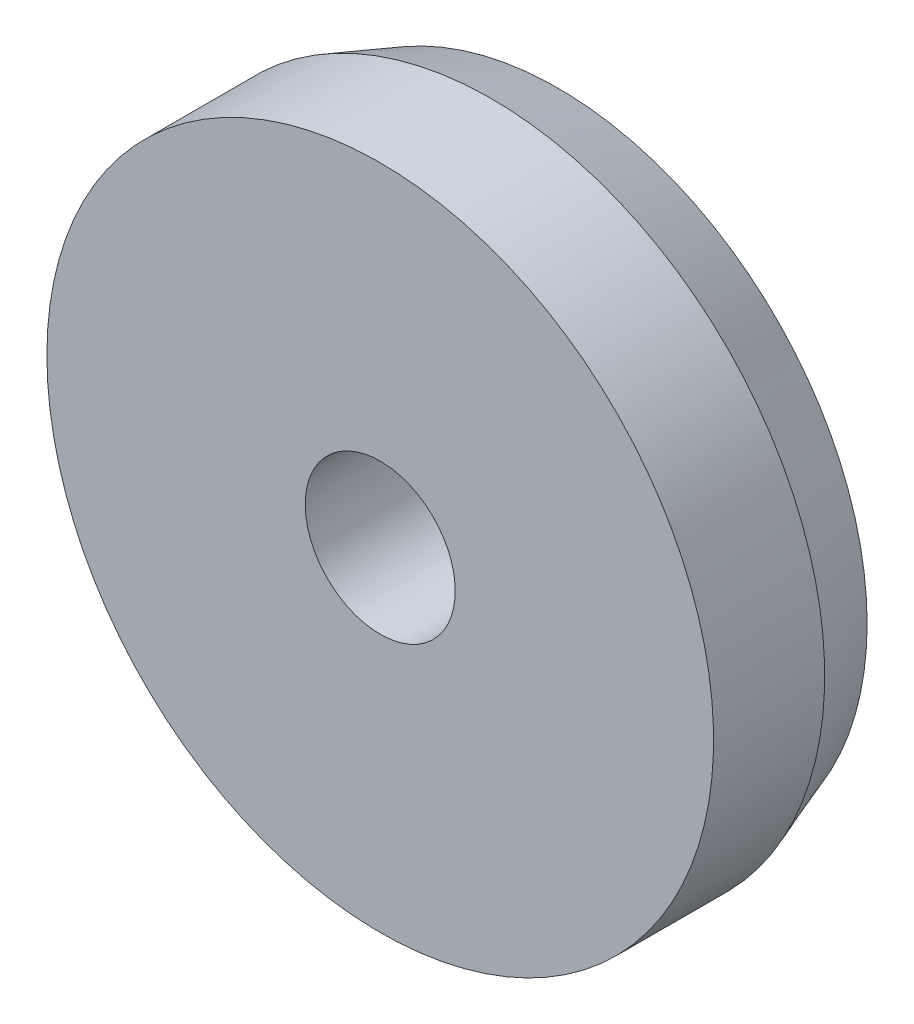
ISO-10303-21;
HEADER;
FILE_DESCRIPTION(('STEP AP214'),'2;1');
FILE_NAME('part.step','',(''),(''),'','','');
FILE_SCHEMA(('AUTOMOTIVE_DESIGN { 1 0 10303 214 1 1 1 1 }'));
ENDSEC;
DATA;
#1=APPLICATION_CONTEXT('core data for automotive mechanical design processes');
#2=APPLICATION_PROTOCOL_DEFINITION('international standard','automotive_design',2000,#1);
#3=PRODUCT_CONTEXT('',#1,'mechanical');
#4=PRODUCT('Part','Part','',(#3));
#5=PRODUCT_RELATED_PRODUCT_CATEGORY('part','',(#4));
#6=PRODUCT_DEFINITION_FORMATION('','',#4);
#7=PRODUCT_DEFINITION_CONTEXT('part definition',#1,'design');
#8=PRODUCT_DEFINITION('design','',#6,#7);
#9=PRODUCT_DEFINITION_SHAPE('','',#8);
#10=(LENGTH_UNIT() NAMED_UNIT(*) SI_UNIT(.MILLI.,.METRE.));
#11=(NAMED_UNIT(*) PLANE_ANGLE_UNIT() SI_UNIT($,.RADIAN.));
#12=(NAMED_UNIT(*) SI_UNIT($,.STERADIAN.) SOLID_ANGLE_UNIT());
#13=UNCERTAINTY_MEASURE_WITH_UNIT(LENGTH_MEASURE(1.E-05),#10,'distance_accuracy_value','');
#14=(GEOMETRIC_REPRESENTATION_CONTEXT(3) GLOBAL_UNCERTAINTY_ASSIGNED_CONTEXT((#13)) GLOBAL_UNIT_ASSIGNED_CONTEXT((#10,
#11,#12)) REPRESENTATION_CONTEXT('',''));
#15=CARTESIAN_POINT('',(0.,0.,0.));
#16=DIRECTION('',(0.,0.,1.));
#17=DIRECTION('',(1.,0.,0.));
#18=AXIS2_PLACEMENT_3D('',#15,#16,#17);
#19=CARTESIAN_POINT('',(-2.66226199830052,-6.07408479977046,-1.99));
#20=DIRECTION('',(0.,0.,1.));
#21=DIRECTION('',(1.,0.,0.));
#22=AXIS2_PLACEMENT_3D('',#19,#20,#21);
#23=CONICAL_SURFACE('',#22,0.556323571888056,0.349065850398862);
#24=CARTESIAN_POINT('',(-2.66226199830052,-6.07408479977046,-1.87));
#25=DIRECTION('',(0.,0.,-1.));
#26=DIRECTION('',(-1.,0.,0.));
#27=AXIS2_PLACEMENT_3D('',#24,#25,#26);
#28=CIRCLE('',#27,0.599999999999999);
#29=CARTESIAN_POINT('',(-3.26226199830052,-6.07408479977046,-1.87));
#30=VERTEX_POINT('',#29);
#31=EDGE_CURVE('E52',#30,#30,#28,.T.);
#32=ORIENTED_EDGE('',*,*,#31,.T.);
#33=EDGE_LOOP('',(#32));
#34=FACE_BOUND('',#33,.T.);
#35=CARTESIAN_POINT('',(-2.66226199830052,-6.07408479977046,-1.99));
#36=DIRECTION('',(0.,0.,-1.));
#37=DIRECTION('',(-1.,0.,0.));
#38=AXIS2_PLACEMENT_3D('',#35,#36,#37);
#39=CIRCLE('',#38,0.556323571888056);
#40=CARTESIAN_POINT('',(-3.21858557018857,-6.07408479977046,-1.99));
#41=VERTEX_POINT('',#40);
#42=EDGE_CURVE('E10',#41,#41,#39,.T.);
#43=ORIENTED_EDGE('',*,*,#42,.F.);
#44=EDGE_LOOP('',(#43));
#45=FACE_BOUND('',#44,.T.);
#46=ADVANCED_FACE('F30',(#34,#45),#23,.T.);
#47=CARTESIAN_POINT('',(-2.21226199830052,-6.07408479977046,-1.99));
#48=DIRECTION('',(0.,0.,-1.));
#49=DIRECTION('',(-1.,0.,0.));
#50=AXIS2_PLACEMENT_3D('',#47,#48,#49);
#51=PLANE('',#50);
#52=ORIENTED_EDGE('',*,*,#42,.T.);
#53=EDGE_LOOP('',(#52));
#54=FACE_BOUND('',#53,.T.);
#55=CARTESIAN_POINT('',(-2.66226199830052,-6.07408479977046,-1.99));
#56=DIRECTION('',(0.,0.,-1.));
#57=DIRECTION('',(-1.,0.,0.));
#58=AXIS2_PLACEMENT_3D('',#55,#56,#57);
#59=CIRCLE('',#58,0.45);
#60=CARTESIAN_POINT('',(-3.11226199830052,-6.07408479977046,-1.99));
#61=VERTEX_POINT('',#60);
#62=EDGE_CURVE('E36',#61,#61,#59,.T.);
#63=ORIENTED_EDGE('',*,*,#62,.F.);
#64=EDGE_LOOP('',(#63));
#65=FACE_BOUND('',#64,.T.);
#66=ADVANCED_FACE('F70',(#54,#65),#51,.T.);
#67=CARTESIAN_POINT('',(-2.66226199830052,-6.07408479977046,-2.6978125));
#68=DIRECTION('',(0.,0.,-1.));
#69=DIRECTION('',(1.,0.,0.));
#70=AXIS2_PLACEMENT_3D('',#67,#68,#69);
#71=SPHERICAL_SURFACE('',#70,0.838748195322201);
#72=ORIENTED_EDGE('',*,*,#62,.T.);
#73=EDGE_LOOP('',(#72));
#74=FACE_BOUND('',#73,.T.);
#75=CARTESIAN_POINT('',(-2.66226199830052,-6.07408479977046,-1.87));
#76=DIRECTION('',(0.,0.,-1.));
#77=DIRECTION('',(-1.,0.,0.));
#78=AXIS2_PLACEMENT_3D('',#75,#76,#77);
#79=CIRCLE('',#78,0.135);
#80=CARTESIAN_POINT('',(-2.79726199830052,-6.07408479977046,-1.87));
#81=VERTEX_POINT('',#80);
#82=EDGE_CURVE('E40',#81,#81,#79,.T.);
#83=ORIENTED_EDGE('',*,*,#82,.F.);
#84=EDGE_LOOP('',(#83));
#85=FACE_BOUND('',#84,.T.);
#86=ADVANCED_FACE('F74',(#74,#85),#71,.F.);
#87=CARTESIAN_POINT('',(-2.66226199830052,-6.07408479977046,-1.67));
#88=DIRECTION('',(0.,0.,-1.));
#89=DIRECTION('',(-1.,0.,0.));
#90=AXIS2_PLACEMENT_3D('',#87,#88,#89);
#91=CYLINDRICAL_SURFACE('',#90,0.135);
#92=ORIENTED_EDGE('',*,*,#82,.T.);
#93=EDGE_LOOP('',(#92));
#94=FACE_BOUND('',#93,.T.);
#95=CARTESIAN_POINT('',(-2.66226199830052,-6.07408479977046,-1.67));
#96=DIRECTION('',(0.,0.,-1.));
#97=DIRECTION('',(-1.,0.,0.));
#98=AXIS2_PLACEMENT_3D('',#95,#96,#97);
#99=CIRCLE('',#98,0.135);
#100=CARTESIAN_POINT('',(-2.79726199830052,-6.07408479977046,-1.67));
#101=VERTEX_POINT('',#100);
#102=EDGE_CURVE('E44',#101,#101,#99,.T.);
#103=ORIENTED_EDGE('',*,*,#102,.F.);
#104=EDGE_LOOP('',(#103));
#105=FACE_BOUND('',#104,.T.);
#106=ADVANCED_FACE('F66',(#94,#105),#91,.F.);
#107=CARTESIAN_POINT('',(-2.06226199830052,-6.07408479977046,-1.67));
#108=DIRECTION('',(0.,0.,1.));
#109=DIRECTION('',(1.,0.,0.));
#110=AXIS2_PLACEMENT_3D('',#107,#108,#109);
#111=PLANE('',#110);
#112=ORIENTED_EDGE('',*,*,#102,.T.);
#113=EDGE_LOOP('',(#112));
#114=FACE_BOUND('',#113,.T.);
#115=CARTESIAN_POINT('',(-2.66226199830052,-6.07408479977046,-1.67));
#116=DIRECTION('',(0.,0.,-1.));
#117=DIRECTION('',(-1.,0.,0.));
#118=AXIS2_PLACEMENT_3D('',#115,#116,#117);
#119=CIRCLE('',#118,0.599999999999999);
#120=CARTESIAN_POINT('',(-3.26226199830052,-6.07408479977046,-1.67));
#121=VERTEX_POINT('',#120);
#122=EDGE_CURVE('E49',#121,#121,#119,.T.);
#123=ORIENTED_EDGE('',*,*,#122,.F.);
#124=EDGE_LOOP('',(#123));
#125=FACE_BOUND('',#124,.T.);
#126=ADVANCED_FACE('F60',(#114,#125),#111,.T.);
#127=CARTESIAN_POINT('',(-2.66226199830052,-6.07408479977046,-1.67));
#128=DIRECTION('',(0.,0.,-1.));
#129=DIRECTION('',(-1.,0.,0.));
#130=AXIS2_PLACEMENT_3D('',#127,#128,#129);
#131=CYLINDRICAL_SURFACE('',#130,0.599999999999999);
#132=ORIENTED_EDGE('',*,*,#122,.T.);
#133=EDGE_LOOP('',(#132));
#134=FACE_BOUND('',#133,.T.);
#135=ORIENTED_EDGE('',*,*,#31,.F.);
#136=EDGE_LOOP('',(#135));
#137=FACE_BOUND('',#136,.T.);
#138=ADVANCED_FACE('F58',(#134,#137),#131,.T.);
#139=CLOSED_SHELL('',(#46,#66,#86,#106,#126,#138));
#140=MANIFOLD_SOLID_BREP('B2',#139);
#141=ADVANCED_BREP_SHAPE_REPRESENTATION('',(#18,#140),#14);
#142=SHAPE_DEFINITION_REPRESENTATION(#9,#141);
ENDSEC;
END-ISO-10303-21;
